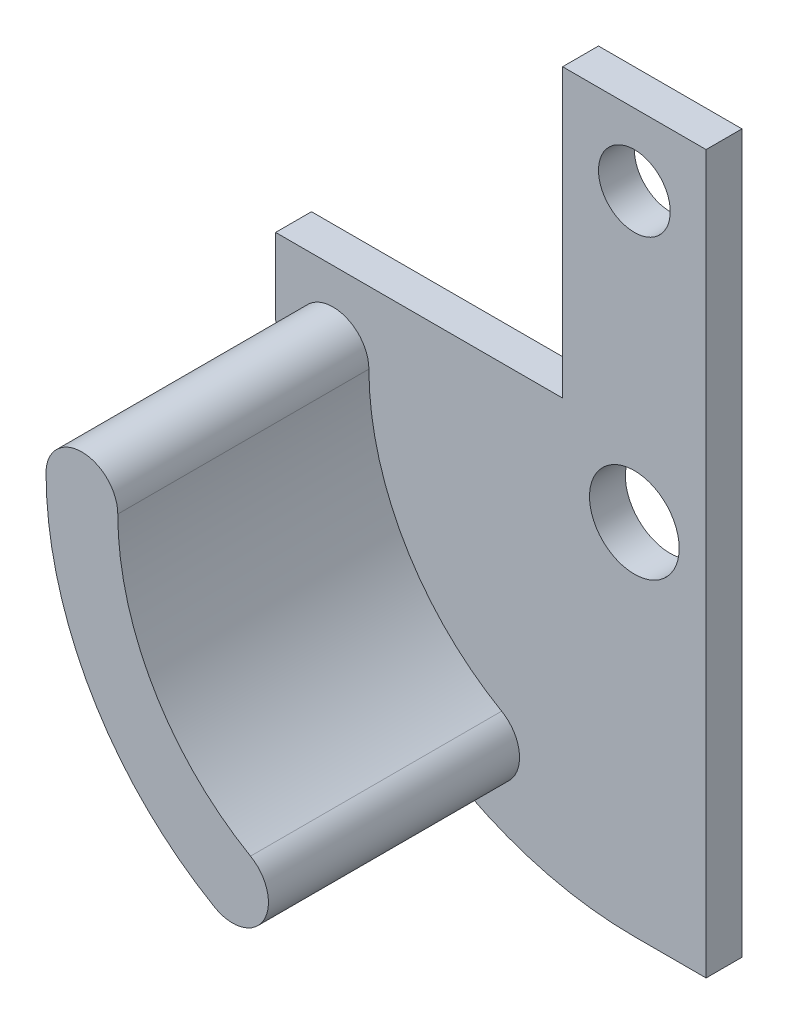
ISO-10303-21;
HEADER;
FILE_DESCRIPTION(('STEP AP214'),'2;1');
FILE_NAME('part.step','',(''),(''),'','','');
FILE_SCHEMA(('AUTOMOTIVE_DESIGN { 1 0 10303 214 1 1 1 1 }'));
ENDSEC;
DATA;
#1=APPLICATION_CONTEXT('core data for automotive mechanical design processes');
#2=APPLICATION_PROTOCOL_DEFINITION('international standard','automotive_design',2000,#1);
#3=PRODUCT_CONTEXT('',#1,'mechanical');
#4=PRODUCT('Part','Part','',(#3));
#5=PRODUCT_RELATED_PRODUCT_CATEGORY('part','',(#4));
#6=PRODUCT_DEFINITION_FORMATION('','',#4);
#7=PRODUCT_DEFINITION_CONTEXT('part definition',#1,'design');
#8=PRODUCT_DEFINITION('design','',#6,#7);
#9=PRODUCT_DEFINITION_SHAPE('','',#8);
#10=(LENGTH_UNIT() NAMED_UNIT(*) SI_UNIT(.MILLI.,.METRE.));
#11=(NAMED_UNIT(*) PLANE_ANGLE_UNIT() SI_UNIT($,.RADIAN.));
#12=(NAMED_UNIT(*) SI_UNIT($,.STERADIAN.) SOLID_ANGLE_UNIT());
#13=UNCERTAINTY_MEASURE_WITH_UNIT(LENGTH_MEASURE(1.E-05),#10,'distance_accuracy_value','');
#14=(GEOMETRIC_REPRESENTATION_CONTEXT(3) GLOBAL_UNCERTAINTY_ASSIGNED_CONTEXT((#13)) GLOBAL_UNIT_ASSIGNED_CONTEXT((#10,
#11,#12)) REPRESENTATION_CONTEXT('',''));
#15=CARTESIAN_POINT('',(0.,0.,0.));
#16=DIRECTION('',(0.,0.,1.));
#17=DIRECTION('',(1.,0.,0.));
#18=AXIS2_PLACEMENT_3D('',#15,#16,#17);
#19=CARTESIAN_POINT('',(0.,0.,3.175));
#20=DIRECTION('',(0.,0.,-1.));
#21=DIRECTION('',(-1.,0.,0.));
#22=AXIS2_PLACEMENT_3D('',#19,#20,#21);
#23=CYLINDRICAL_SURFACE('',#22,31.75);
#24=CARTESIAN_POINT('',(0.,0.,0.));
#25=DIRECTION('',(0.,0.,1.));
#26=DIRECTION('',(-1.,0.,0.));
#27=AXIS2_PLACEMENT_3D('',#24,#25,#26);
#28=CIRCLE('',#27,31.75);
#29=CARTESIAN_POINT('',(-31.75,0.,0.));
#30=VERTEX_POINT('',#29);
#31=CARTESIAN_POINT('',(0.,-31.75,0.));
#32=VERTEX_POINT('',#31);
#33=EDGE_CURVE('E161',#30,#32,#28,.T.);
#34=ORIENTED_EDGE('',*,*,#33,.T.);
#35=DIRECTION('',(0.,0.,-1.));
#36=VECTOR('',#35,1.);
#37=CARTESIAN_POINT('',(0.,-31.75,3.175));
#38=LINE('',#37,#36);
#39=CARTESIAN_POINT('',(0.,-31.75,3.175));
#40=VERTEX_POINT('',#39);
#41=EDGE_CURVE('E11',#40,#32,#38,.T.);
#42=ORIENTED_EDGE('',*,*,#41,.F.);
#43=CARTESIAN_POINT('',(0.,0.,3.175));
#44=DIRECTION('',(0.,0.,1.));
#45=DIRECTION('',(-1.,0.,0.));
#46=AXIS2_PLACEMENT_3D('',#43,#44,#45);
#47=CIRCLE('',#46,31.75);
#48=CARTESIAN_POINT('',(-31.75,0.,3.175));
#49=VERTEX_POINT('',#48);
#50=EDGE_CURVE('E169',#49,#40,#47,.T.);
#51=ORIENTED_EDGE('',*,*,#50,.F.);
#52=DIRECTION('',(0.,0.,-1.));
#53=VECTOR('',#52,1.);
#54=CARTESIAN_POINT('',(-31.75,0.,3.175));
#55=LINE('',#54,#53);
#56=EDGE_CURVE('E192',#49,#30,#55,.T.);
#57=ORIENTED_EDGE('',*,*,#56,.T.);
#58=EDGE_LOOP('',(#34,#42,#51,#57));
#59=FACE_BOUND('',#58,.T.);
#60=ADVANCED_FACE('F39',(#59),#23,.T.);
#61=CARTESIAN_POINT('',(0.,-31.75,3.175));
#62=DIRECTION('',(0.,1.,0.));
#63=DIRECTION('',(0.,0.,1.));
#64=AXIS2_PLACEMENT_3D('',#61,#62,#63);
#65=PLANE('',#64);
#66=DIRECTION('',(1.,0.,0.));
#67=VECTOR('',#66,1.);
#68=CARTESIAN_POINT('',(0.,-31.75,0.));
#69=LINE('',#68,#67);
#70=CARTESIAN_POINT('',(6.35,-31.75,0.));
#71=VERTEX_POINT('',#70);
#72=EDGE_CURVE('E196',#32,#71,#69,.T.);
#73=ORIENTED_EDGE('',*,*,#72,.T.);
#74=DIRECTION('',(0.,0.,-1.));
#75=VECTOR('',#74,1.);
#76=CARTESIAN_POINT('',(6.35,-31.75,3.175));
#77=LINE('',#76,#75);
#78=CARTESIAN_POINT('',(6.35,-31.75,3.175));
#79=VERTEX_POINT('',#78);
#80=EDGE_CURVE('E47',#79,#71,#77,.T.);
#81=ORIENTED_EDGE('',*,*,#80,.F.);
#82=DIRECTION('',(1.,0.,0.));
#83=VECTOR('',#82,1.);
#84=CARTESIAN_POINT('',(0.,-31.75,3.175));
#85=LINE('',#84,#83);
#86=EDGE_CURVE('E173',#40,#79,#85,.T.);
#87=ORIENTED_EDGE('',*,*,#86,.F.);
#88=ORIENTED_EDGE('',*,*,#41,.T.);
#89=EDGE_LOOP('',(#73,#81,#87,#88));
#90=FACE_BOUND('',#89,.T.);
#91=ADVANCED_FACE('F240',(#90),#65,.F.);
#92=CARTESIAN_POINT('',(6.35,6.35,3.175));
#93=DIRECTION('',(-1.,0.,0.));
#94=DIRECTION('',(0.,0.,1.));
#95=AXIS2_PLACEMENT_3D('',#92,#93,#94);
#96=PLANE('',#95);
#97=DIRECTION('',(0.,1.,0.));
#98=VECTOR('',#97,1.);
#99=CARTESIAN_POINT('',(6.35,6.35,0.));
#100=LINE('',#99,#98);
#101=CARTESIAN_POINT('',(6.35,31.75,0.));
#102=VERTEX_POINT('',#101);
#103=EDGE_CURVE('E200',#71,#102,#100,.T.);
#104=ORIENTED_EDGE('',*,*,#103,.T.);
#105=DIRECTION('',(0.,0.,-1.));
#106=VECTOR('',#105,1.);
#107=CARTESIAN_POINT('',(6.35,31.75,3.175));
#108=LINE('',#107,#106);
#109=CARTESIAN_POINT('',(6.35,31.75,3.175));
#110=VERTEX_POINT('',#109);
#111=EDGE_CURVE('E229',#110,#102,#108,.T.);
#112=ORIENTED_EDGE('',*,*,#111,.F.);
#113=DIRECTION('',(0.,1.,0.));
#114=VECTOR('',#113,1.);
#115=CARTESIAN_POINT('',(6.35,-31.75,3.175));
#116=LINE('',#115,#114);
#117=EDGE_CURVE('E177',#79,#110,#116,.T.);
#118=ORIENTED_EDGE('',*,*,#117,.F.);
#119=ORIENTED_EDGE('',*,*,#80,.T.);
#120=EDGE_LOOP('',(#104,#112,#118,#119));
#121=FACE_BOUND('',#120,.T.);
#122=ADVANCED_FACE('F237',(#121),#96,.F.);
#123=CARTESIAN_POINT('',(6.35,31.75,3.175));
#124=DIRECTION('',(0.,-1.,0.));
#125=DIRECTION('',(0.,0.,-1.));
#126=AXIS2_PLACEMENT_3D('',#123,#124,#125);
#127=PLANE('',#126);
#128=DIRECTION('',(-1.,0.,0.));
#129=VECTOR('',#128,1.);
#130=CARTESIAN_POINT('',(6.35,31.75,0.));
#131=LINE('',#130,#129);
#132=CARTESIAN_POINT('',(-6.35,31.75,0.));
#133=VERTEX_POINT('',#132);
#134=EDGE_CURVE('E203',#102,#133,#131,.T.);
#135=ORIENTED_EDGE('',*,*,#134,.T.);
#136=DIRECTION('',(0.,0.,-1.));
#137=VECTOR('',#136,1.);
#138=CARTESIAN_POINT('',(-6.35,31.75,3.175));
#139=LINE('',#138,#137);
#140=CARTESIAN_POINT('',(-6.35,31.75,3.175));
#141=VERTEX_POINT('',#140);
#142=EDGE_CURVE('E225',#141,#133,#139,.T.);
#143=ORIENTED_EDGE('',*,*,#142,.F.);
#144=DIRECTION('',(-1.,0.,0.));
#145=VECTOR('',#144,1.);
#146=CARTESIAN_POINT('',(6.35,31.75,3.175));
#147=LINE('',#146,#145);
#148=EDGE_CURVE('E180',#110,#141,#147,.T.);
#149=ORIENTED_EDGE('',*,*,#148,.F.);
#150=ORIENTED_EDGE('',*,*,#111,.T.);
#151=EDGE_LOOP('',(#135,#143,#149,#150));
#152=FACE_BOUND('',#151,.T.);
#153=ADVANCED_FACE('F251',(#152),#127,.F.);
#154=CARTESIAN_POINT('',(-6.35,31.75,3.175));
#155=DIRECTION('',(1.,0.,0.));
#156=DIRECTION('',(0.,1.,0.));
#157=AXIS2_PLACEMENT_3D('',#154,#155,#156);
#158=PLANE('',#157);
#159=DIRECTION('',(0.,-1.,0.));
#160=VECTOR('',#159,1.);
#161=CARTESIAN_POINT('',(-6.35,31.75,0.));
#162=LINE('',#161,#160);
#163=CARTESIAN_POINT('',(-6.35,6.35,0.));
#164=VERTEX_POINT('',#163);
#165=EDGE_CURVE('E206',#133,#164,#162,.T.);
#166=ORIENTED_EDGE('',*,*,#165,.T.);
#167=DIRECTION('',(0.,0.,-1.));
#168=VECTOR('',#167,1.);
#169=CARTESIAN_POINT('',(-6.35,6.35,3.175));
#170=LINE('',#169,#168);
#171=CARTESIAN_POINT('',(-6.35,6.35,3.175));
#172=VERTEX_POINT('',#171);
#173=EDGE_CURVE('E221',#172,#164,#170,.T.);
#174=ORIENTED_EDGE('',*,*,#173,.F.);
#175=DIRECTION('',(0.,-1.,0.));
#176=VECTOR('',#175,1.);
#177=CARTESIAN_POINT('',(-6.35,31.75,3.175));
#178=LINE('',#177,#176);
#179=EDGE_CURVE('E183',#141,#172,#178,.T.);
#180=ORIENTED_EDGE('',*,*,#179,.F.);
#181=ORIENTED_EDGE('',*,*,#142,.T.);
#182=EDGE_LOOP('',(#166,#174,#180,#181));
#183=FACE_BOUND('',#182,.T.);
#184=ADVANCED_FACE('F255',(#183),#158,.F.);
#185=CARTESIAN_POINT('',(-6.35,6.35,3.175));
#186=DIRECTION('',(0.,-1.,0.));
#187=DIRECTION('',(1.,0.,0.));
#188=AXIS2_PLACEMENT_3D('',#185,#186,#187);
#189=PLANE('',#188);
#190=DIRECTION('',(-1.,0.,0.));
#191=VECTOR('',#190,1.);
#192=CARTESIAN_POINT('',(-6.35,6.35,0.));
#193=LINE('',#192,#191);
#194=CARTESIAN_POINT('',(-31.75,6.35,0.));
#195=VERTEX_POINT('',#194);
#196=EDGE_CURVE('E209',#164,#195,#193,.T.);
#197=ORIENTED_EDGE('',*,*,#196,.T.);
#198=DIRECTION('',(0.,0.,-1.));
#199=VECTOR('',#198,1.);
#200=CARTESIAN_POINT('',(-31.75,6.35,3.175));
#201=LINE('',#200,#199);
#202=CARTESIAN_POINT('',(-31.75,6.35,3.175));
#203=VERTEX_POINT('',#202);
#204=EDGE_CURVE('E217',#203,#195,#201,.T.);
#205=ORIENTED_EDGE('',*,*,#204,.F.);
#206=DIRECTION('',(-1.,0.,0.));
#207=VECTOR('',#206,1.);
#208=CARTESIAN_POINT('',(-6.35,6.35,3.175));
#209=LINE('',#208,#207);
#210=EDGE_CURVE('E186',#172,#203,#209,.T.);
#211=ORIENTED_EDGE('',*,*,#210,.F.);
#212=ORIENTED_EDGE('',*,*,#173,.T.);
#213=EDGE_LOOP('',(#197,#205,#211,#212));
#214=FACE_BOUND('',#213,.T.);
#215=ADVANCED_FACE('F268',(#214),#189,.F.);
#216=CARTESIAN_POINT('',(-31.75,0.,3.175));
#217=DIRECTION('',(1.,0.,0.));
#218=DIRECTION('',(0.,0.,-1.));
#219=AXIS2_PLACEMENT_3D('',#216,#217,#218);
#220=PLANE('',#219);
#221=DIRECTION('',(0.,-1.,0.));
#222=VECTOR('',#221,1.);
#223=CARTESIAN_POINT('',(-31.75,0.,0.));
#224=LINE('',#223,#222);
#225=EDGE_CURVE('E174',#195,#30,#224,.T.);
#226=ORIENTED_EDGE('',*,*,#225,.T.);
#227=ORIENTED_EDGE('',*,*,#56,.F.);
#228=DIRECTION('',(0.,-1.,0.));
#229=VECTOR('',#228,1.);
#230=CARTESIAN_POINT('',(-31.75,0.,3.175));
#231=LINE('',#230,#229);
#232=EDGE_CURVE('E189',#203,#49,#231,.T.);
#233=ORIENTED_EDGE('',*,*,#232,.F.);
#234=ORIENTED_EDGE('',*,*,#204,.T.);
#235=EDGE_LOOP('',(#226,#227,#233,#234));
#236=FACE_BOUND('',#235,.T.);
#237=ADVANCED_FACE('F266',(#236),#220,.F.);
#238=CARTESIAN_POINT('',(0.,0.,3.175));
#239=DIRECTION('',(0.,0.,-1.));
#240=DIRECTION('',(-1.,0.,0.));
#241=AXIS2_PLACEMENT_3D('',#238,#239,#240);
#242=PLANE('',#241);
#243=CARTESIAN_POINT('',(0.,0.,3.175));
#244=DIRECTION('',(0.,0.,1.));
#245=DIRECTION('',(-1.,0.,0.));
#246=AXIS2_PLACEMENT_3D('',#243,#244,#245);
#247=CIRCLE('',#246,29.845);
#248=CARTESIAN_POINT('',(-29.845,1.00397121172158E-13,3.175));
#249=VERTEX_POINT('',#248);
#250=CARTESIAN_POINT('',(-14.9224999999999,-25.8465281759466,3.175));
#251=VERTEX_POINT('',#250);
#252=EDGE_CURVE('E144',#249,#251,#247,.T.);
#253=ORIENTED_EDGE('',*,*,#252,.F.);
#254=CARTESIAN_POINT('',(-26.67,0.,3.175));
#255=DIRECTION('',(0.,0.,1.));
#256=DIRECTION('',(-1.,0.,0.));
#257=AXIS2_PLACEMENT_3D('',#254,#255,#256);
#258=CIRCLE('',#257,3.175);
#259=CARTESIAN_POINT('',(-23.495,0.,3.175));
#260=VERTEX_POINT('',#259);
#261=EDGE_CURVE('E141',#260,#249,#258,.T.);
#262=ORIENTED_EDGE('',*,*,#261,.F.);
#263=CARTESIAN_POINT('',(0.,0.,3.175));
#264=DIRECTION('',(0.,0.,-1.));
#265=DIRECTION('',(-1.,0.,0.));
#266=AXIS2_PLACEMENT_3D('',#263,#264,#265);
#267=CIRCLE('',#266,23.495);
#268=CARTESIAN_POINT('',(-11.7474999999999,-20.3472668619154,3.175));
#269=VERTEX_POINT('',#268);
#270=EDGE_CURVE('E59',#269,#260,#267,.T.);
#271=ORIENTED_EDGE('',*,*,#270,.F.);
#272=CARTESIAN_POINT('',(-13.3349999999999,-23.096897518931,3.175));
#273=DIRECTION('',(0.,0.,1.));
#274=DIRECTION('',(-1.,0.,0.));
#275=AXIS2_PLACEMENT_3D('',#272,#273,#274);
#276=CIRCLE('',#275,3.175);
#277=EDGE_CURVE('E54',#251,#269,#276,.T.);
#278=ORIENTED_EDGE('',*,*,#277,.F.);
#279=EDGE_LOOP('',(#253,#262,#271,#278));
#280=FACE_BOUND('',#279,.T.);
#281=CARTESIAN_POINT('',(0.,0.,3.175));
#282=DIRECTION('',(0.,0.,1.));
#283=DIRECTION('',(1.,0.,0.));
#284=AXIS2_PLACEMENT_3D('',#281,#282,#283);
#285=CIRCLE('',#284,3.96875);
#286=CARTESIAN_POINT('',(3.96875,0.,3.175));
#287=VERTEX_POINT('',#286);
#288=EDGE_CURVE('E162',#287,#287,#285,.T.);
#289=ORIENTED_EDGE('',*,*,#288,.F.);
#290=EDGE_LOOP('',(#289));
#291=FACE_BOUND('',#290,.T.);
#292=CARTESIAN_POINT('',(0.,25.4,3.175));
#293=DIRECTION('',(0.,0.,1.));
#294=DIRECTION('',(1.,0.,0.));
#295=AXIS2_PLACEMENT_3D('',#292,#293,#294);
#296=CIRCLE('',#295,3.175);
#297=CARTESIAN_POINT('',(3.175,25.4,3.175));
#298=VERTEX_POINT('',#297);
#299=EDGE_CURVE('E146',#298,#298,#296,.T.);
#300=ORIENTED_EDGE('',*,*,#299,.F.);
#301=EDGE_LOOP('',(#300));
#302=FACE_BOUND('',#301,.T.);
#303=ORIENTED_EDGE('',*,*,#50,.T.);
#304=ORIENTED_EDGE('',*,*,#86,.T.);
#305=ORIENTED_EDGE('',*,*,#117,.T.);
#306=ORIENTED_EDGE('',*,*,#148,.T.);
#307=ORIENTED_EDGE('',*,*,#179,.T.);
#308=ORIENTED_EDGE('',*,*,#210,.T.);
#309=ORIENTED_EDGE('',*,*,#232,.T.);
#310=EDGE_LOOP('',(#303,#304,#305,#306,#307,#308,#309));
#311=FACE_BOUND('',#310,.T.);
#312=ADVANCED_FACE('F259',(#280,#291,#302,#311),#242,.F.);
#313=CARTESIAN_POINT('',(0.,0.,0.));
#314=DIRECTION('',(0.,0.,-1.));
#315=DIRECTION('',(-1.,0.,0.));
#316=AXIS2_PLACEMENT_3D('',#313,#314,#315);
#317=PLANE('',#316);
#318=CARTESIAN_POINT('',(0.,0.,0.));
#319=DIRECTION('',(0.,0.,1.));
#320=DIRECTION('',(1.,0.,0.));
#321=AXIS2_PLACEMENT_3D('',#318,#319,#320);
#322=CIRCLE('',#321,3.96875);
#323=CARTESIAN_POINT('',(3.96875,0.,0.));
#324=VERTEX_POINT('',#323);
#325=EDGE_CURVE('E157',#324,#324,#322,.T.);
#326=ORIENTED_EDGE('',*,*,#325,.T.);
#327=EDGE_LOOP('',(#326));
#328=FACE_BOUND('',#327,.T.);
#329=CARTESIAN_POINT('',(0.,25.4,0.));
#330=DIRECTION('',(0.,0.,1.));
#331=DIRECTION('',(1.,0.,0.));
#332=AXIS2_PLACEMENT_3D('',#329,#330,#331);
#333=CIRCLE('',#332,3.175);
#334=CARTESIAN_POINT('',(3.175,25.4,0.));
#335=VERTEX_POINT('',#334);
#336=EDGE_CURVE('E151',#335,#335,#333,.T.);
#337=ORIENTED_EDGE('',*,*,#336,.T.);
#338=EDGE_LOOP('',(#337));
#339=FACE_BOUND('',#338,.T.);
#340=ORIENTED_EDGE('',*,*,#33,.F.);
#341=ORIENTED_EDGE('',*,*,#225,.F.);
#342=ORIENTED_EDGE('',*,*,#196,.F.);
#343=ORIENTED_EDGE('',*,*,#165,.F.);
#344=ORIENTED_EDGE('',*,*,#134,.F.);
#345=ORIENTED_EDGE('',*,*,#103,.F.);
#346=ORIENTED_EDGE('',*,*,#72,.F.);
#347=EDGE_LOOP('',(#340,#341,#342,#343,#344,#345,#346));
#348=FACE_BOUND('',#347,.T.);
#349=ADVANCED_FACE('F244',(#328,#339,#348),#317,.T.);
#350=CARTESIAN_POINT('',(0.,25.4,0.));
#351=DIRECTION('',(0.,0.,1.));
#352=DIRECTION('',(1.,0.,0.));
#353=AXIS2_PLACEMENT_3D('',#350,#351,#352);
#354=CYLINDRICAL_SURFACE('',#353,3.175);
#355=ORIENTED_EDGE('',*,*,#336,.F.);
#356=EDGE_LOOP('',(#355));
#357=FACE_BOUND('',#356,.T.);
#358=ORIENTED_EDGE('',*,*,#299,.T.);
#359=EDGE_LOOP('',(#358));
#360=FACE_BOUND('',#359,.T.);
#361=ADVANCED_FACE('F316',(#357,#360),#354,.F.);
#362=CARTESIAN_POINT('',(0.,0.,0.));
#363=DIRECTION('',(0.,0.,1.));
#364=DIRECTION('',(1.,0.,0.));
#365=AXIS2_PLACEMENT_3D('',#362,#363,#364);
#366=CYLINDRICAL_SURFACE('',#365,3.96875);
#367=ORIENTED_EDGE('',*,*,#325,.F.);
#368=EDGE_LOOP('',(#367));
#369=FACE_BOUND('',#368,.T.);
#370=ORIENTED_EDGE('',*,*,#288,.T.);
#371=EDGE_LOOP('',(#370));
#372=FACE_BOUND('',#371,.T.);
#373=ADVANCED_FACE('F326',(#369,#372),#366,.F.);
#374=CARTESIAN_POINT('',(0.,0.,25.4));
#375=DIRECTION('',(0.,0.,-1.));
#376=DIRECTION('',(-1.,0.,0.));
#377=AXIS2_PLACEMENT_3D('',#374,#375,#376);
#378=CYLINDRICAL_SURFACE('',#377,29.845);
#379=ORIENTED_EDGE('',*,*,#252,.T.);
#380=DIRECTION('',(0.,0.,-1.));
#381=VECTOR('',#380,1.);
#382=CARTESIAN_POINT('',(-14.9224999999999,-25.8465281759466,25.4));
#383=LINE('',#382,#381);
#384=CARTESIAN_POINT('',(-14.9224999999999,-25.8465281759466,25.4));
#385=VERTEX_POINT('',#384);
#386=EDGE_CURVE('E123',#385,#251,#383,.T.);
#387=ORIENTED_EDGE('',*,*,#386,.F.);
#388=CARTESIAN_POINT('',(0.,0.,25.4));
#389=DIRECTION('',(0.,0.,1.));
#390=DIRECTION('',(-1.,0.,0.));
#391=AXIS2_PLACEMENT_3D('',#388,#389,#390);
#392=CIRCLE('',#391,29.845);
#393=CARTESIAN_POINT('',(-29.845,1.00397121172158E-13,25.4));
#394=VERTEX_POINT('',#393);
#395=EDGE_CURVE('E131',#394,#385,#392,.T.);
#396=ORIENTED_EDGE('',*,*,#395,.F.);
#397=DIRECTION('',(0.,0.,-1.));
#398=VECTOR('',#397,1.);
#399=CARTESIAN_POINT('',(-29.845,1.00397121172158E-13,25.4));
#400=LINE('',#399,#398);
#401=EDGE_CURVE('E395',#394,#249,#400,.T.);
#402=ORIENTED_EDGE('',*,*,#401,.T.);
#403=EDGE_LOOP('',(#379,#387,#396,#402));
#404=FACE_BOUND('',#403,.T.);
#405=ADVANCED_FACE('F143',(#404),#378,.T.);
#406=CARTESIAN_POINT('',(-13.3349999999999,-23.096897518931,25.4));
#407=DIRECTION('',(0.,0.,-1.));
#408=DIRECTION('',(-1.,0.,0.));
#409=AXIS2_PLACEMENT_3D('',#406,#407,#408);
#410=CYLINDRICAL_SURFACE('',#409,3.175);
#411=ORIENTED_EDGE('',*,*,#277,.T.);
#412=DIRECTION('',(0.,0.,-1.));
#413=VECTOR('',#412,1.);
#414=CARTESIAN_POINT('',(-11.7474999999999,-20.3472668619154,25.4));
#415=LINE('',#414,#413);
#416=CARTESIAN_POINT('',(-11.7474999999999,-20.3472668619154,25.4));
#417=VERTEX_POINT('',#416);
#418=EDGE_CURVE('E126',#417,#269,#415,.T.);
#419=ORIENTED_EDGE('',*,*,#418,.F.);
#420=CARTESIAN_POINT('',(-13.3349999999999,-23.096897518931,25.4));
#421=DIRECTION('',(0.,0.,1.));
#422=DIRECTION('',(-1.,0.,0.));
#423=AXIS2_PLACEMENT_3D('',#420,#421,#422);
#424=CIRCLE('',#423,3.175);
#425=EDGE_CURVE('E119',#385,#417,#424,.T.);
#426=ORIENTED_EDGE('',*,*,#425,.F.);
#427=ORIENTED_EDGE('',*,*,#386,.T.);
#428=EDGE_LOOP('',(#411,#419,#426,#427));
#429=FACE_BOUND('',#428,.T.);
#430=ADVANCED_FACE('F121',(#429),#410,.T.);
#431=CARTESIAN_POINT('',(0.,0.,25.4));
#432=DIRECTION('',(0.,0.,-1.));
#433=DIRECTION('',(-1.,0.,0.));
#434=AXIS2_PLACEMENT_3D('',#431,#432,#433);
#435=CYLINDRICAL_SURFACE('',#434,23.495);
#436=ORIENTED_EDGE('',*,*,#270,.T.);
#437=DIRECTION('',(0.,0.,-1.));
#438=VECTOR('',#437,1.);
#439=CARTESIAN_POINT('',(-23.495,0.,25.4));
#440=LINE('',#439,#438);
#441=CARTESIAN_POINT('',(-23.495,0.,25.4));
#442=VERTEX_POINT('',#441);
#443=EDGE_CURVE('E153',#442,#260,#440,.T.);
#444=ORIENTED_EDGE('',*,*,#443,.F.);
#445=CARTESIAN_POINT('',(0.,0.,25.4));
#446=DIRECTION('',(0.,0.,-1.));
#447=DIRECTION('',(-1.,0.,0.));
#448=AXIS2_PLACEMENT_3D('',#445,#446,#447);
#449=CIRCLE('',#448,23.495);
#450=EDGE_CURVE('E130',#417,#442,#449,.T.);
#451=ORIENTED_EDGE('',*,*,#450,.F.);
#452=ORIENTED_EDGE('',*,*,#418,.T.);
#453=EDGE_LOOP('',(#436,#444,#451,#452));
#454=FACE_BOUND('',#453,.T.);
#455=ADVANCED_FACE('F359',(#454),#435,.F.);
#456=CARTESIAN_POINT('',(-26.67,0.,25.4));
#457=DIRECTION('',(0.,0.,-1.));
#458=DIRECTION('',(-1.,0.,0.));
#459=AXIS2_PLACEMENT_3D('',#456,#457,#458);
#460=CYLINDRICAL_SURFACE('',#459,3.175);
#461=ORIENTED_EDGE('',*,*,#261,.T.);
#462=ORIENTED_EDGE('',*,*,#401,.F.);
#463=CARTESIAN_POINT('',(-26.67,0.,25.4));
#464=DIRECTION('',(0.,0.,1.));
#465=DIRECTION('',(-1.,0.,0.));
#466=AXIS2_PLACEMENT_3D('',#463,#464,#465);
#467=CIRCLE('',#466,3.175);
#468=EDGE_CURVE('E136',#442,#394,#467,.T.);
#469=ORIENTED_EDGE('',*,*,#468,.F.);
#470=ORIENTED_EDGE('',*,*,#443,.T.);
#471=EDGE_LOOP('',(#461,#462,#469,#470));
#472=FACE_BOUND('',#471,.T.);
#473=ADVANCED_FACE('F368',(#472),#460,.T.);
#474=CARTESIAN_POINT('',(-13.335,0.,25.4));
#475=DIRECTION('',(0.,0.,-1.));
#476=DIRECTION('',(-1.,0.,0.));
#477=AXIS2_PLACEMENT_3D('',#474,#475,#476);
#478=PLANE('',#477);
#479=ORIENTED_EDGE('',*,*,#395,.T.);
#480=ORIENTED_EDGE('',*,*,#425,.T.);
#481=ORIENTED_EDGE('',*,*,#450,.T.);
#482=ORIENTED_EDGE('',*,*,#468,.T.);
#483=EDGE_LOOP('',(#479,#480,#481,#482));
#484=FACE_BOUND('',#483,.T.);
#485=ADVANCED_FACE('F134',(#484),#478,.F.);
#486=CLOSED_SHELL('',(#60,#91,#122,#153,#184,#215,#237,#312,#349,#361,#373,#405,#430,#455,#473,#485));
#487=MANIFOLD_SOLID_BREP('B2',#486);
#488=ADVANCED_BREP_SHAPE_REPRESENTATION('',(#18,#487),#14);
#489=SHAPE_DEFINITION_REPRESENTATION(#9,#488);
ENDSEC;
END-ISO-10303-21;
